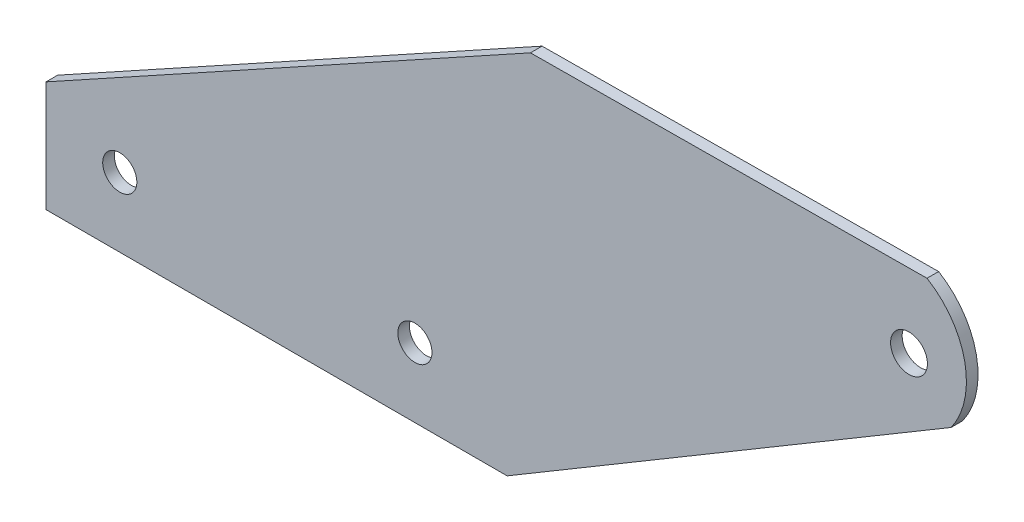
ISO-10303-21;
HEADER;
FILE_DESCRIPTION(('STEP AP214'),'2;1');
FILE_NAME('part.step','',(''),(''),'','','');
FILE_SCHEMA(('AUTOMOTIVE_DESIGN { 1 0 10303 214 1 1 1 1 }'));
ENDSEC;
DATA;
#1=APPLICATION_CONTEXT('core data for automotive mechanical design processes');
#2=APPLICATION_PROTOCOL_DEFINITION('international standard','automotive_design',2000,#1);
#3=PRODUCT_CONTEXT('',#1,'mechanical');
#4=PRODUCT('Part','Part','',(#3));
#5=PRODUCT_RELATED_PRODUCT_CATEGORY('part','',(#4));
#6=PRODUCT_DEFINITION_FORMATION('','',#4);
#7=PRODUCT_DEFINITION_CONTEXT('part definition',#1,'design');
#8=PRODUCT_DEFINITION('design','',#6,#7);
#9=PRODUCT_DEFINITION_SHAPE('','',#8);
#10=(LENGTH_UNIT() NAMED_UNIT(*) SI_UNIT(.MILLI.,.METRE.));
#11=(NAMED_UNIT(*) PLANE_ANGLE_UNIT() SI_UNIT($,.RADIAN.));
#12=(NAMED_UNIT(*) SI_UNIT($,.STERADIAN.) SOLID_ANGLE_UNIT());
#13=UNCERTAINTY_MEASURE_WITH_UNIT(LENGTH_MEASURE(1.E-05),#10,'distance_accuracy_value','');
#14=(GEOMETRIC_REPRESENTATION_CONTEXT(3) GLOBAL_UNCERTAINTY_ASSIGNED_CONTEXT((#13)) GLOBAL_UNIT_ASSIGNED_CONTEXT((#10,
#11,#12)) REPRESENTATION_CONTEXT('',''));
#15=CARTESIAN_POINT('',(0.,0.,0.));
#16=DIRECTION('',(0.,0.,1.));
#17=DIRECTION('',(1.,0.,0.));
#18=AXIS2_PLACEMENT_3D('',#15,#16,#17);
#19=CARTESIAN_POINT('',(0.,0.,-1.6002));
#20=DIRECTION('',(0.,-1.,0.));
#21=DIRECTION('',(0.,0.,-1.));
#22=AXIS2_PLACEMENT_3D('',#19,#20,#21);
#23=PLANE('',#22);
#24=DIRECTION('',(1.,0.,0.));
#25=VECTOR('',#24,1.);
#26=CARTESIAN_POINT('',(0.,0.,0.));
#27=LINE('',#26,#25);
#28=CARTESIAN_POINT('',(0.,0.,0.));
#29=VERTEX_POINT('',#28);
#30=CARTESIAN_POINT('',(63.5,0.,0.));
#31=VERTEX_POINT('',#30);
#32=EDGE_CURVE('E128',#29,#31,#27,.T.);
#33=ORIENTED_EDGE('',*,*,#32,.F.);
#34=DIRECTION('',(0.,0.,1.));
#35=VECTOR('',#34,1.);
#36=CARTESIAN_POINT('',(0.,0.,-1.6002));
#37=LINE('',#36,#35);
#38=CARTESIAN_POINT('',(0.,0.,-1.6002));
#39=VERTEX_POINT('',#38);
#40=EDGE_CURVE('E11',#39,#29,#37,.T.);
#41=ORIENTED_EDGE('',*,*,#40,.F.);
#42=DIRECTION('',(1.,0.,0.));
#43=VECTOR('',#42,1.);
#44=CARTESIAN_POINT('',(0.,0.,-1.6002));
#45=LINE('',#44,#43);
#46=CARTESIAN_POINT('',(63.5,0.,-1.6002));
#47=VERTEX_POINT('',#46);
#48=EDGE_CURVE('E143',#39,#47,#45,.T.);
#49=ORIENTED_EDGE('',*,*,#48,.T.);
#50=DIRECTION('',(0.,0.,1.));
#51=VECTOR('',#50,1.);
#52=CARTESIAN_POINT('',(63.5,0.,-1.6002));
#53=LINE('',#52,#51);
#54=EDGE_CURVE('E46',#47,#31,#53,.T.);
#55=ORIENTED_EDGE('',*,*,#54,.T.);
#56=EDGE_LOOP('',(#33,#41,#49,#55));
#57=FACE_BOUND('',#56,.T.);
#58=ADVANCED_FACE('F43',(#57),#23,.T.);
#59=CARTESIAN_POINT('',(0.,0.,-1.6002));
#60=DIRECTION('',(-1.,0.,0.));
#61=DIRECTION('',(0.,0.,1.));
#62=AXIS2_PLACEMENT_3D('',#59,#60,#61);
#63=PLANE('',#62);
#64=DIRECTION('',(0.,-1.,0.));
#65=VECTOR('',#64,1.);
#66=CARTESIAN_POINT('',(0.,0.,0.));
#67=LINE('',#66,#65);
#68=CARTESIAN_POINT('',(0.,15.24,0.));
#69=VERTEX_POINT('',#68);
#70=EDGE_CURVE('E141',#69,#29,#67,.T.);
#71=ORIENTED_EDGE('',*,*,#70,.F.);
#72=DIRECTION('',(0.,0.,1.));
#73=VECTOR('',#72,1.);
#74=CARTESIAN_POINT('',(0.,15.24,-1.6002));
#75=LINE('',#74,#73);
#76=CARTESIAN_POINT('',(0.,15.24,-1.6002));
#77=VERTEX_POINT('',#76);
#78=EDGE_CURVE('E52',#77,#69,#75,.T.);
#79=ORIENTED_EDGE('',*,*,#78,.F.);
#80=DIRECTION('',(0.,-1.,0.));
#81=VECTOR('',#80,1.);
#82=CARTESIAN_POINT('',(0.,0.,-1.6002));
#83=LINE('',#82,#81);
#84=EDGE_CURVE('E118',#77,#39,#83,.T.);
#85=ORIENTED_EDGE('',*,*,#84,.T.);
#86=ORIENTED_EDGE('',*,*,#40,.T.);
#87=EDGE_LOOP('',(#71,#79,#85,#86));
#88=FACE_BOUND('',#87,.T.);
#89=ADVANCED_FACE('F151',(#88),#63,.T.);
#90=CARTESIAN_POINT('',(0.,15.24,-1.6002));
#91=DIRECTION('',(-0.483206601960687,0.875506356242835,0.));
#92=DIRECTION('',(-0.875506356242835,-0.483206601960687,0.));
#93=AXIS2_PLACEMENT_3D('',#90,#91,#92);
#94=PLANE('',#93);
#95=DIRECTION('',(-0.875506356242835,-0.483206601960687,0.));
#96=VECTOR('',#95,1.);
#97=CARTESIAN_POINT('',(0.,15.24,0.));
#98=LINE('',#97,#96);
#99=CARTESIAN_POINT('',(66.713584345704,52.0603430694043,0.));
#100=VERTEX_POINT('',#99);
#101=EDGE_CURVE('E105',#100,#69,#98,.T.);
#102=ORIENTED_EDGE('',*,*,#101,.F.);
#103=DIRECTION('',(0.,0.,1.));
#104=VECTOR('',#103,1.);
#105=CARTESIAN_POINT('',(66.713584345704,52.0603430694043,-1.6002));
#106=LINE('',#105,#104);
#107=CARTESIAN_POINT('',(66.713584345704,52.0603430694043,-1.6002));
#108=VERTEX_POINT('',#107);
#109=EDGE_CURVE('E100',#108,#100,#106,.T.);
#110=ORIENTED_EDGE('',*,*,#109,.F.);
#111=DIRECTION('',(-0.875506356242835,-0.483206601960687,0.));
#112=VECTOR('',#111,1.);
#113=CARTESIAN_POINT('',(0.,15.24,-1.6002));
#114=LINE('',#113,#112);
#115=EDGE_CURVE('E103',#108,#77,#114,.T.);
#116=ORIENTED_EDGE('',*,*,#115,.T.);
#117=ORIENTED_EDGE('',*,*,#78,.T.);
#118=EDGE_LOOP('',(#102,#110,#116,#117));
#119=FACE_BOUND('',#118,.T.);
#120=ADVANCED_FACE('F102',(#119),#94,.T.);
#121=CARTESIAN_POINT('',(66.713584345704,52.0603430694043,-1.6002));
#122=DIRECTION('',(-0.00773465915032857,0.999970087076523,0.));
#123=DIRECTION('',(-0.999970087076523,-0.00773465915032857,0.));
#124=AXIS2_PLACEMENT_3D('',#121,#122,#123);
#125=PLANE('',#124);
#126=DIRECTION('',(-0.999970087076523,-0.00773465915032857,0.));
#127=VECTOR('',#126,1.);
#128=CARTESIAN_POINT('',(66.713584345704,52.0603430694043,0.));
#129=LINE('',#128,#127);
#130=CARTESIAN_POINT('',(121.323584345704,52.4827454408936,0.));
#131=VERTEX_POINT('',#130);
#132=EDGE_CURVE('E138',#131,#100,#129,.T.);
#133=ORIENTED_EDGE('',*,*,#132,.F.);
#134=DIRECTION('',(0.,0.,1.));
#135=VECTOR('',#134,1.);
#136=CARTESIAN_POINT('',(121.323584345704,52.4827454408936,-1.6002));
#137=LINE('',#136,#135);
#138=CARTESIAN_POINT('',(121.323584345704,52.4827454408936,-1.6002));
#139=VERTEX_POINT('',#138);
#140=EDGE_CURVE('E110',#139,#131,#137,.T.);
#141=ORIENTED_EDGE('',*,*,#140,.F.);
#142=DIRECTION('',(-0.999970087076523,-0.00773465915032857,0.));
#143=VECTOR('',#142,1.);
#144=CARTESIAN_POINT('',(66.713584345704,52.0603430694043,-1.6002));
#145=LINE('',#144,#143);
#146=EDGE_CURVE('E116',#139,#108,#145,.T.);
#147=ORIENTED_EDGE('',*,*,#146,.T.);
#148=ORIENTED_EDGE('',*,*,#109,.T.);
#149=EDGE_LOOP('',(#133,#141,#147,#148));
#150=FACE_BOUND('',#149,.T.);
#151=ADVANCED_FACE('F120',(#150),#125,.T.);
#152=CARTESIAN_POINT('',(115.557868074149,42.8890344978021,-1.6002));
#153=DIRECTION('',(0.,0.,1.));
#154=DIRECTION('',(1.,0.,0.));
#155=AXIS2_PLACEMENT_3D('',#152,#153,#154);
#156=CYLINDRICAL_SURFACE('',#155,11.1929787716972);
#157=CARTESIAN_POINT('',(115.557868074149,42.8890344978021,0.));
#158=DIRECTION('',(0.,0.,1.));
#159=DIRECTION('',(-1.,0.,0.));
#160=AXIS2_PLACEMENT_3D('',#157,#158,#159);
#161=CIRCLE('',#160,11.1929787716972);
#162=CARTESIAN_POINT('',(124.634833140252,36.3398758516534,0.));
#163=VERTEX_POINT('',#162);
#164=EDGE_CURVE('E135',#163,#131,#161,.T.);
#165=ORIENTED_EDGE('',*,*,#164,.F.);
#166=DIRECTION('',(0.,0.,1.));
#167=VECTOR('',#166,1.);
#168=CARTESIAN_POINT('',(124.634833140252,36.3398758516534,-1.6002));
#169=LINE('',#168,#167);
#170=CARTESIAN_POINT('',(124.634833140252,36.3398758516534,-1.6002));
#171=VERTEX_POINT('',#170);
#172=EDGE_CURVE('E146',#171,#163,#169,.T.);
#173=ORIENTED_EDGE('',*,*,#172,.F.);
#174=CARTESIAN_POINT('',(115.557868074149,42.8890344978021,-1.6002));
#175=DIRECTION('',(0.,0.,1.));
#176=DIRECTION('',(-1.,0.,0.));
#177=AXIS2_PLACEMENT_3D('',#174,#175,#176);
#178=CIRCLE('',#177,11.1929787716972);
#179=EDGE_CURVE('E121',#171,#139,#178,.T.);
#180=ORIENTED_EDGE('',*,*,#179,.T.);
#181=ORIENTED_EDGE('',*,*,#140,.T.);
#182=EDGE_LOOP('',(#165,#173,#180,#181));
#183=FACE_BOUND('',#182,.T.);
#184=ADVANCED_FACE('F164',(#183),#156,.T.);
#185=CARTESIAN_POINT('',(124.634833140252,36.3398758516535,-1.6002));
#186=DIRECTION('',(0.510965633459694,-0.859601140892178,0.));
#187=DIRECTION('',(0.859601140892178,0.510965633459694,0.));
#188=AXIS2_PLACEMENT_3D('',#185,#186,#187);
#189=PLANE('',#188);
#190=DIRECTION('',(0.859601140892178,0.510965633459694,0.));
#191=VECTOR('',#190,1.);
#192=CARTESIAN_POINT('',(124.634833140252,36.3398758516535,0.));
#193=LINE('',#192,#191);
#194=EDGE_CURVE('E131',#31,#163,#193,.T.);
#195=ORIENTED_EDGE('',*,*,#194,.F.);
#196=ORIENTED_EDGE('',*,*,#54,.F.);
#197=DIRECTION('',(0.859601140892178,0.510965633459694,0.));
#198=VECTOR('',#197,1.);
#199=CARTESIAN_POINT('',(124.634833140252,36.3398758516535,-1.6002));
#200=LINE('',#199,#198);
#201=EDGE_CURVE('E123',#47,#171,#200,.T.);
#202=ORIENTED_EDGE('',*,*,#201,.T.);
#203=ORIENTED_EDGE('',*,*,#172,.T.);
#204=EDGE_LOOP('',(#195,#196,#202,#203));
#205=FACE_BOUND('',#204,.T.);
#206=ADVANCED_FACE('F148',(#205),#189,.T.);
#207=CARTESIAN_POINT('',(115.557868074149,42.8890344978021,-1.6002));
#208=DIRECTION('',(0.,0.,-1.));
#209=DIRECTION('',(-1.,0.,0.));
#210=AXIS2_PLACEMENT_3D('',#207,#208,#209);
#211=PLANE('',#210);
#212=CARTESIAN_POINT('',(50.8,9.525,-1.6002));
#213=DIRECTION('',(0.,0.,1.));
#214=DIRECTION('',(1.,0.,0.));
#215=AXIS2_PLACEMENT_3D('',#212,#213,#214);
#216=CIRCLE('',#215,2.3495);
#217=CARTESIAN_POINT('',(53.1495,9.525,-1.6002));
#218=VERTEX_POINT('',#217);
#219=EDGE_CURVE('E194',#218,#218,#216,.T.);
#220=ORIENTED_EDGE('',*,*,#219,.T.);
#221=EDGE_LOOP('',(#220));
#222=FACE_BOUND('',#221,.T.);
#223=CARTESIAN_POINT('',(10.16,9.525,-1.6002));
#224=DIRECTION('',(0.,0.,1.));
#225=DIRECTION('',(1.,0.,0.));
#226=AXIS2_PLACEMENT_3D('',#223,#224,#225);
#227=CIRCLE('',#226,2.3495);
#228=CARTESIAN_POINT('',(12.5095,9.525,-1.6002));
#229=VERTEX_POINT('',#228);
#230=EDGE_CURVE('E202',#229,#229,#227,.T.);
#231=ORIENTED_EDGE('',*,*,#230,.T.);
#232=EDGE_LOOP('',(#231));
#233=FACE_BOUND('',#232,.T.);
#234=CARTESIAN_POINT('',(118.841606935984,42.3032436929538,-1.6002));
#235=DIRECTION('',(0.,0.,1.));
#236=DIRECTION('',(1.,0.,0.));
#237=AXIS2_PLACEMENT_3D('',#234,#235,#236);
#238=CIRCLE('',#237,2.54);
#239=CARTESIAN_POINT('',(121.381606935984,42.3032436929538,-1.6002));
#240=VERTEX_POINT('',#239);
#241=EDGE_CURVE('E132',#240,#240,#238,.T.);
#242=ORIENTED_EDGE('',*,*,#241,.T.);
#243=EDGE_LOOP('',(#242));
#244=FACE_BOUND('',#243,.T.);
#245=ORIENTED_EDGE('',*,*,#48,.F.);
#246=ORIENTED_EDGE('',*,*,#84,.F.);
#247=ORIENTED_EDGE('',*,*,#115,.F.);
#248=ORIENTED_EDGE('',*,*,#146,.F.);
#249=ORIENTED_EDGE('',*,*,#179,.F.);
#250=ORIENTED_EDGE('',*,*,#201,.F.);
#251=EDGE_LOOP('',(#245,#246,#247,#248,#249,#250));
#252=FACE_BOUND('',#251,.T.);
#253=ADVANCED_FACE('F114',(#222,#233,#244,#252),#211,.T.);
#254=CARTESIAN_POINT('',(115.557868074149,42.8890344978021,0.));
#255=DIRECTION('',(0.,0.,-1.));
#256=DIRECTION('',(-1.,0.,0.));
#257=AXIS2_PLACEMENT_3D('',#254,#255,#256);
#258=PLANE('',#257);
#259=CARTESIAN_POINT('',(50.8,9.525,0.));
#260=DIRECTION('',(0.,0.,1.));
#261=DIRECTION('',(1.,0.,0.));
#262=AXIS2_PLACEMENT_3D('',#259,#260,#261);
#263=CIRCLE('',#262,2.3495);
#264=CARTESIAN_POINT('',(53.1495,9.525,0.));
#265=VERTEX_POINT('',#264);
#266=EDGE_CURVE('E197',#265,#265,#263,.T.);
#267=ORIENTED_EDGE('',*,*,#266,.F.);
#268=EDGE_LOOP('',(#267));
#269=FACE_BOUND('',#268,.T.);
#270=CARTESIAN_POINT('',(10.16,9.525,0.));
#271=DIRECTION('',(0.,0.,1.));
#272=DIRECTION('',(1.,0.,0.));
#273=AXIS2_PLACEMENT_3D('',#270,#271,#272);
#274=CIRCLE('',#273,2.3495);
#275=CARTESIAN_POINT('',(12.5095,9.525,0.));
#276=VERTEX_POINT('',#275);
#277=EDGE_CURVE('E199',#276,#276,#274,.T.);
#278=ORIENTED_EDGE('',*,*,#277,.F.);
#279=EDGE_LOOP('',(#278));
#280=FACE_BOUND('',#279,.T.);
#281=CARTESIAN_POINT('',(118.841606935984,42.3032436929538,0.));
#282=DIRECTION('',(0.,0.,1.));
#283=DIRECTION('',(1.,0.,0.));
#284=AXIS2_PLACEMENT_3D('',#281,#282,#283);
#285=CIRCLE('',#284,2.54);
#286=CARTESIAN_POINT('',(121.381606935984,42.3032436929538,0.));
#287=VERTEX_POINT('',#286);
#288=EDGE_CURVE('E205',#287,#287,#285,.T.);
#289=ORIENTED_EDGE('',*,*,#288,.F.);
#290=EDGE_LOOP('',(#289));
#291=FACE_BOUND('',#290,.T.);
#292=ORIENTED_EDGE('',*,*,#32,.T.);
#293=ORIENTED_EDGE('',*,*,#194,.T.);
#294=ORIENTED_EDGE('',*,*,#164,.T.);
#295=ORIENTED_EDGE('',*,*,#132,.T.);
#296=ORIENTED_EDGE('',*,*,#101,.T.);
#297=ORIENTED_EDGE('',*,*,#70,.T.);
#298=EDGE_LOOP('',(#292,#293,#294,#295,#296,#297));
#299=FACE_BOUND('',#298,.T.);
#300=ADVANCED_FACE('F150',(#269,#280,#291,#299),#258,.F.);
#301=CARTESIAN_POINT('',(118.841606935984,42.3032436929538,-1.6002));
#302=DIRECTION('',(0.,0.,1.));
#303=DIRECTION('',(1.,0.,0.));
#304=AXIS2_PLACEMENT_3D('',#301,#302,#303);
#305=CYLINDRICAL_SURFACE('',#304,2.54);
#306=ORIENTED_EDGE('',*,*,#241,.F.);
#307=EDGE_LOOP('',(#306));
#308=FACE_BOUND('',#307,.T.);
#309=ORIENTED_EDGE('',*,*,#288,.T.);
#310=EDGE_LOOP('',(#309));
#311=FACE_BOUND('',#310,.T.);
#312=ADVANCED_FACE('F175',(#308,#311),#305,.F.);
#313=CARTESIAN_POINT('',(10.16,9.525,-1.6002));
#314=DIRECTION('',(0.,0.,1.));
#315=DIRECTION('',(1.,0.,0.));
#316=AXIS2_PLACEMENT_3D('',#313,#314,#315);
#317=CYLINDRICAL_SURFACE('',#316,2.3495);
#318=ORIENTED_EDGE('',*,*,#230,.F.);
#319=EDGE_LOOP('',(#318));
#320=FACE_BOUND('',#319,.T.);
#321=ORIENTED_EDGE('',*,*,#277,.T.);
#322=EDGE_LOOP('',(#321));
#323=FACE_BOUND('',#322,.T.);
#324=ADVANCED_FACE('F182',(#320,#323),#317,.F.);
#325=CARTESIAN_POINT('',(50.8,9.525,-1.6002));
#326=DIRECTION('',(0.,0.,1.));
#327=DIRECTION('',(1.,0.,0.));
#328=AXIS2_PLACEMENT_3D('',#325,#326,#327);
#329=CYLINDRICAL_SURFACE('',#328,2.3495);
#330=ORIENTED_EDGE('',*,*,#219,.F.);
#331=EDGE_LOOP('',(#330));
#332=FACE_BOUND('',#331,.T.);
#333=ORIENTED_EDGE('',*,*,#266,.T.);
#334=EDGE_LOOP('',(#333));
#335=FACE_BOUND('',#334,.T.);
#336=ADVANCED_FACE('F186',(#332,#335),#329,.F.);
#337=CLOSED_SHELL('',(#58,#89,#120,#151,#184,#206,#253,#300,#312,#324,#336));
#338=MANIFOLD_SOLID_BREP('B2',#337);
#339=ADVANCED_BREP_SHAPE_REPRESENTATION('',(#18,#338),#14);
#340=SHAPE_DEFINITION_REPRESENTATION(#9,#339);
ENDSEC;
END-ISO-10303-21;
